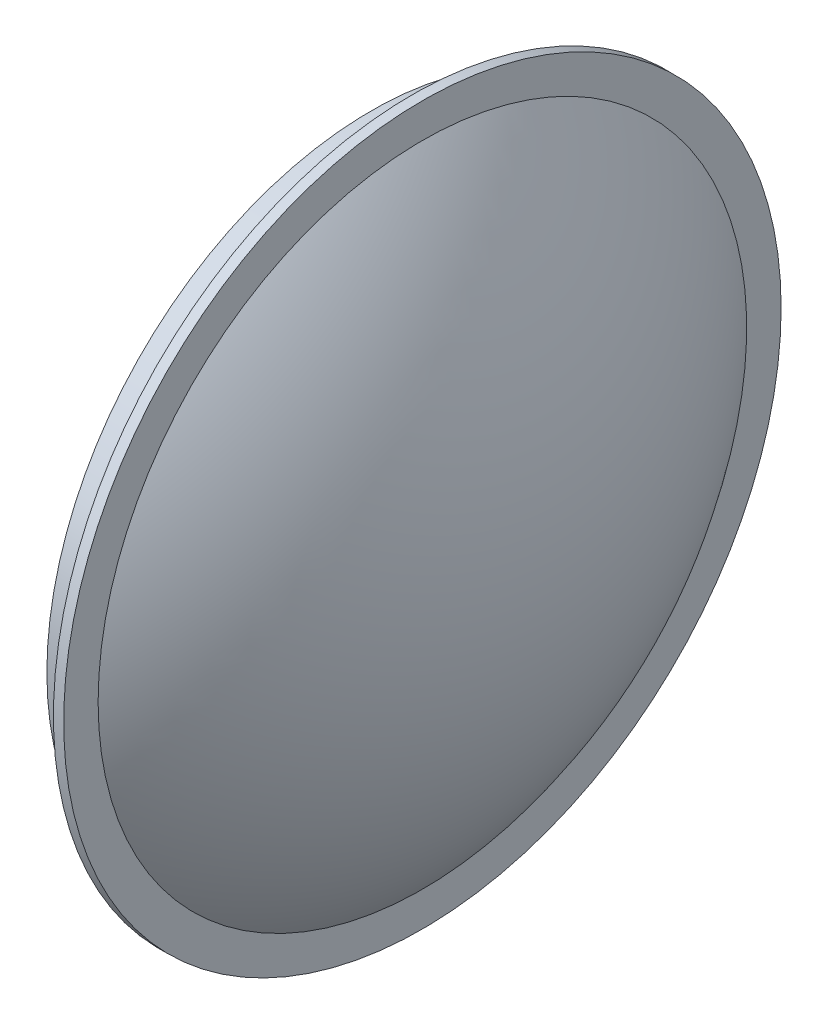
ISO-10303-21;
HEADER;
FILE_DESCRIPTION(('STEP AP214'),'2;1');
FILE_NAME('part.step','',(''),(''),'','','');
FILE_SCHEMA(('AUTOMOTIVE_DESIGN { 1 0 10303 214 1 1 1 1 }'));
ENDSEC;
DATA;
#1=APPLICATION_CONTEXT('core data for automotive mechanical design processes');
#2=APPLICATION_PROTOCOL_DEFINITION('international standard','automotive_design',2000,#1);
#3=PRODUCT_CONTEXT('',#1,'mechanical');
#4=PRODUCT('Part','Part','',(#3));
#5=PRODUCT_RELATED_PRODUCT_CATEGORY('part','',(#4));
#6=PRODUCT_DEFINITION_FORMATION('','',#4);
#7=PRODUCT_DEFINITION_CONTEXT('part definition',#1,'design');
#8=PRODUCT_DEFINITION('design','',#6,#7);
#9=PRODUCT_DEFINITION_SHAPE('','',#8);
#10=(LENGTH_UNIT() NAMED_UNIT(*) SI_UNIT(.MILLI.,.METRE.));
#11=(NAMED_UNIT(*) PLANE_ANGLE_UNIT() SI_UNIT($,.RADIAN.));
#12=(NAMED_UNIT(*) SI_UNIT($,.STERADIAN.) SOLID_ANGLE_UNIT());
#13=UNCERTAINTY_MEASURE_WITH_UNIT(LENGTH_MEASURE(1.E-05),#10,'distance_accuracy_value','');
#14=(GEOMETRIC_REPRESENTATION_CONTEXT(3) GLOBAL_UNCERTAINTY_ASSIGNED_CONTEXT((#13)) GLOBAL_UNIT_ASSIGNED_CONTEXT((#10,
#11,#12)) REPRESENTATION_CONTEXT('',''));
#15=CARTESIAN_POINT('',(0.,0.,0.));
#16=DIRECTION('',(0.,0.,1.));
#17=DIRECTION('',(1.,0.,0.));
#18=AXIS2_PLACEMENT_3D('',#15,#16,#17);
#19=CARTESIAN_POINT('',(350.,0.,0.));
#20=DIRECTION('',(1.,0.,0.));
#21=DIRECTION('',(0.,0.,-1.));
#22=AXIS2_PLACEMENT_3D('',#19,#20,#21);
#23=CYLINDRICAL_SURFACE('',#22,316.385840391127);
#24=CARTESIAN_POINT('',(350.,0.,0.));
#25=DIRECTION('',(-1.,0.,0.));
#26=DIRECTION('',(0.,0.,1.));
#27=AXIS2_PLACEMENT_3D('',#24,#25,#26);
#28=CIRCLE('',#27,316.385840391127);
#29=CARTESIAN_POINT('',(350.,0.,316.385840391127));
#30=VERTEX_POINT('',#29);
#31=EDGE_CURVE('E52',#30,#30,#28,.T.);
#32=ORIENTED_EDGE('',*,*,#31,.F.);
#33=EDGE_LOOP('',(#32));
#34=FACE_BOUND('',#33,.T.);
#35=CARTESIAN_POINT('',(390.,0.,0.));
#36=DIRECTION('',(1.,0.,0.));
#37=DIRECTION('',(0.,0.,-1.));
#38=AXIS2_PLACEMENT_3D('',#35,#36,#37);
#39=CIRCLE('',#38,316.385840391127);
#40=CARTESIAN_POINT('',(390.,0.,-316.385840391127));
#41=VERTEX_POINT('',#40);
#42=EDGE_CURVE('E10',#41,#41,#39,.T.);
#43=ORIENTED_EDGE('',*,*,#42,.F.);
#44=EDGE_LOOP('',(#43));
#45=FACE_BOUND('',#44,.T.);
#46=ADVANCED_FACE('F39',(#34,#45),#23,.T.);
#47=CARTESIAN_POINT('',(0.,0.,0.));
#48=DIRECTION('',(0.,1.,0.));
#49=DIRECTION('',(1.,0.,0.));
#50=AXIS2_PLACEMENT_3D('',#47,#48,#49);
#51=SPHERICAL_SURFACE('',#50,500.);
#52=CARTESIAN_POINT('',(0.,0.,0.));
#53=DIRECTION('',(1.,0.,0.));
#54=DIRECTION('',(0.,0.,-1.));
#55=AXIS2_PLACEMENT_3D('',#52,#53,#54);
#56=SPHERICAL_SURFACE('',#55,500.);
#57=CARTESIAN_POINT('',(400.,0.,0.));
#58=DIRECTION('',(1.,0.,0.));
#59=DIRECTION('',(0.,0.,-1.));
#60=AXIS2_PLACEMENT_3D('',#57,#58,#59);
#61=CIRCLE('',#60,300.);
#62=CARTESIAN_POINT('',(400.,0.,-300.));
#63=VERTEX_POINT('',#62);
#64=EDGE_CURVE('E47',#63,#63,#61,.T.);
#65=ORIENTED_EDGE('',*,*,#64,.F.);
#66=EDGE_LOOP('',(#65));
#67=FACE_BOUND('',#66,.T.);
#68=ADVANCED_FACE('F41',(#67),#56,.F.);
#69=CARTESIAN_POINT('',(350.,0.,0.));
#70=DIRECTION('',(-1.,0.,0.));
#71=DIRECTION('',(0.,0.,1.));
#72=AXIS2_PLACEMENT_3D('',#69,#70,#71);
#73=PLANE('',#72);
#74=ORIENTED_EDGE('',*,*,#31,.T.);
#75=EDGE_LOOP('',(#74));
#76=FACE_BOUND('',#75,.T.);
#77=CARTESIAN_POINT('',(350.,0.,0.));
#78=DIRECTION('',(-1.,0.,0.));
#79=DIRECTION('',(0.,0.,1.));
#80=AXIS2_PLACEMENT_3D('',#77,#78,#79);
#81=CIRCLE('',#80,300.);
#82=CARTESIAN_POINT('',(350.,0.,300.));
#83=VERTEX_POINT('',#82);
#84=EDGE_CURVE('E62',#83,#83,#81,.T.);
#85=ORIENTED_EDGE('',*,*,#84,.F.);
#86=EDGE_LOOP('',(#85));
#87=FACE_BOUND('',#86,.T.);
#88=ADVANCED_FACE('F98',(#76,#87),#73,.T.);
#89=CARTESIAN_POINT('',(350.,0.,0.));
#90=DIRECTION('',(1.,0.,0.));
#91=DIRECTION('',(0.,0.,-1.));
#92=AXIS2_PLACEMENT_3D('',#89,#90,#91);
#93=CYLINDRICAL_SURFACE('',#92,300.);
#94=ORIENTED_EDGE('',*,*,#84,.T.);
#95=EDGE_LOOP('',(#94));
#96=FACE_BOUND('',#95,.T.);
#97=ORIENTED_EDGE('',*,*,#64,.T.);
#98=EDGE_LOOP('',(#97));
#99=FACE_BOUND('',#98,.T.);
#100=ADVANCED_FACE('F90',(#96,#99),#93,.F.);
#101=CARTESIAN_POINT('',(390.,0.,0.));
#102=DIRECTION('',(1.,0.,0.));
#103=DIRECTION('',(0.,0.,-1.));
#104=AXIS2_PLACEMENT_3D('',#101,#102,#103);
#105=CYLINDRICAL_SURFACE('',#104,350.);
#106=CARTESIAN_POINT('',(390.,0.,0.));
#107=DIRECTION('',(1.,0.,0.));
#108=DIRECTION('',(0.,0.,-1.));
#109=AXIS2_PLACEMENT_3D('',#106,#107,#108);
#110=CIRCLE('',#109,350.);
#111=CARTESIAN_POINT('',(390.,0.,-350.));
#112=VERTEX_POINT('',#111);
#113=EDGE_CURVE('E67',#112,#112,#110,.T.);
#114=ORIENTED_EDGE('',*,*,#113,.T.);
#115=EDGE_LOOP('',(#114));
#116=FACE_BOUND('',#115,.T.);
#117=CARTESIAN_POINT('',(400.,0.,0.));
#118=DIRECTION('',(1.,0.,0.));
#119=DIRECTION('',(0.,0.,-1.));
#120=AXIS2_PLACEMENT_3D('',#117,#118,#119);
#121=CIRCLE('',#120,350.);
#122=CARTESIAN_POINT('',(400.,0.,-350.));
#123=VERTEX_POINT('',#122);
#124=EDGE_CURVE('E68',#123,#123,#121,.T.);
#125=ORIENTED_EDGE('',*,*,#124,.F.);
#126=EDGE_LOOP('',(#125));
#127=FACE_BOUND('',#126,.T.);
#128=ADVANCED_FACE('F76',(#116,#127),#105,.T.);
#129=CARTESIAN_POINT('',(390.,0.,0.));
#130=DIRECTION('',(1.,0.,0.));
#131=DIRECTION('',(0.,0.,-1.));
#132=AXIS2_PLACEMENT_3D('',#129,#130,#131);
#133=PLANE('',#132);
#134=ORIENTED_EDGE('',*,*,#42,.T.);
#135=EDGE_LOOP('',(#134));
#136=FACE_BOUND('',#135,.T.);
#137=ORIENTED_EDGE('',*,*,#113,.F.);
#138=EDGE_LOOP('',(#137));
#139=FACE_BOUND('',#138,.T.);
#140=ADVANCED_FACE('F79',(#136,#139),#133,.F.);
#141=CARTESIAN_POINT('',(400.,0.,0.));
#142=DIRECTION('',(1.,0.,0.));
#143=DIRECTION('',(0.,0.,-1.));
#144=AXIS2_PLACEMENT_3D('',#141,#142,#143);
#145=PLANE('',#144);
#146=CARTESIAN_POINT('',(400.,0.,0.));
#147=DIRECTION('',(-1.,0.,0.));
#148=DIRECTION('',(0.,0.,1.));
#149=AXIS2_PLACEMENT_3D('',#146,#147,#148);
#150=CIRCLE('',#149,316.385840391127);
#151=CARTESIAN_POINT('',(400.,0.,316.385840391127));
#152=VERTEX_POINT('',#151);
#153=EDGE_CURVE('E57',#152,#152,#150,.T.);
#154=ORIENTED_EDGE('',*,*,#153,.T.);
#155=EDGE_LOOP('',(#154));
#156=FACE_BOUND('',#155,.T.);
#157=ORIENTED_EDGE('',*,*,#124,.T.);
#158=EDGE_LOOP('',(#157));
#159=FACE_BOUND('',#158,.T.);
#160=ADVANCED_FACE('F81',(#156,#159),#145,.T.);
#161=CARTESIAN_POINT('',(0.,0.,0.));
#162=DIRECTION('',(0.,1.,0.));
#163=DIRECTION('',(1.,0.,0.));
#164=AXIS2_PLACEMENT_3D('',#161,#162,#163);
#165=SPHERICAL_SURFACE('',#164,510.);
#166=CARTESIAN_POINT('',(0.,0.,0.));
#167=DIRECTION('',(-1.,0.,0.));
#168=DIRECTION('',(0.,0.,1.));
#169=AXIS2_PLACEMENT_3D('',#166,#167,#168);
#170=SPHERICAL_SURFACE('',#169,510.);
#171=ORIENTED_EDGE('',*,*,#153,.F.);
#172=EDGE_LOOP('',(#171));
#173=FACE_BOUND('',#172,.T.);
#174=ADVANCED_FACE('F87',(#173),#170,.T.);
#175=CLOSED_SHELL('',(#46,#68,#88,#100,#128,#140,#160,#174));
#176=MANIFOLD_SOLID_BREP('B2',#175);
#177=ADVANCED_BREP_SHAPE_REPRESENTATION('',(#18,#176),#14);
#178=SHAPE_DEFINITION_REPRESENTATION(#9,#177);
ENDSEC;
END-ISO-10303-21;
